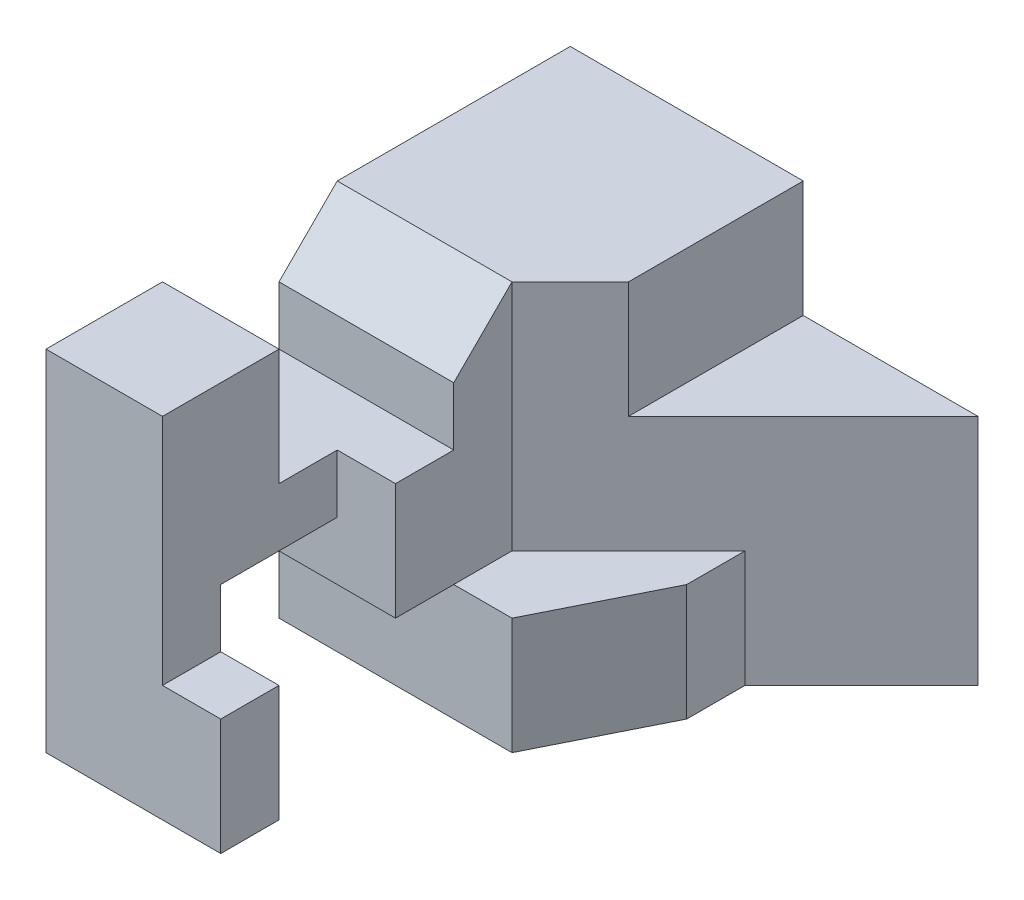
ISO-10303-21;
HEADER;
FILE_DESCRIPTION(('STEP AP214'),'2;1');
FILE_NAME('part.step','',(''),(''),'','','');
FILE_SCHEMA(('AUTOMOTIVE_DESIGN { 1 0 10303 214 1 1 1 1 }'));
ENDSEC;
DATA;
#1=APPLICATION_CONTEXT('core data for automotive mechanical design processes');
#2=APPLICATION_PROTOCOL_DEFINITION('international standard','automotive_design',2000,#1);
#3=PRODUCT_CONTEXT('',#1,'mechanical');
#4=PRODUCT('Part','Part','',(#3));
#5=PRODUCT_RELATED_PRODUCT_CATEGORY('part','',(#4));
#6=PRODUCT_DEFINITION_FORMATION('','',#4);
#7=PRODUCT_DEFINITION_CONTEXT('part definition',#1,'design');
#8=PRODUCT_DEFINITION('design','',#6,#7);
#9=PRODUCT_DEFINITION_SHAPE('','',#8);
#10=(LENGTH_UNIT() NAMED_UNIT(*) SI_UNIT(.MILLI.,.METRE.));
#11=(NAMED_UNIT(*) PLANE_ANGLE_UNIT() SI_UNIT($,.RADIAN.));
#12=(NAMED_UNIT(*) SI_UNIT($,.STERADIAN.) SOLID_ANGLE_UNIT());
#13=UNCERTAINTY_MEASURE_WITH_UNIT(LENGTH_MEASURE(1.E-05),#10,'distance_accuracy_value','');
#14=(GEOMETRIC_REPRESENTATION_CONTEXT(3) GLOBAL_UNCERTAINTY_ASSIGNED_CONTEXT((#13)) GLOBAL_UNIT_ASSIGNED_CONTEXT((#10,
#11,#12)) REPRESENTATION_CONTEXT('',''));
#15=CARTESIAN_POINT('',(0.,0.,0.));
#16=DIRECTION('',(0.,0.,1.));
#17=DIRECTION('',(1.,0.,0.));
#18=AXIS2_PLACEMENT_3D('',#15,#16,#17);
#19=CARTESIAN_POINT('',(3.5,3.,9.));
#20=DIRECTION('',(0.,-1.,0.));
#21=DIRECTION('',(1.,0.,0.));
#22=AXIS2_PLACEMENT_3D('',#19,#20,#21);
#23=PLANE('',#22);
#24=DIRECTION('',(0.,0.,-1.));
#25=VECTOR('',#24,1.);
#26=CARTESIAN_POINT('',(-3.5,3.,9.));
#27=LINE('',#26,#25);
#28=CARTESIAN_POINT('',(-3.5,3.,4.));
#29=VERTEX_POINT('',#28);
#30=CARTESIAN_POINT('',(-3.5,3.,0.));
#31=VERTEX_POINT('',#30);
#32=EDGE_CURVE('E259',#29,#31,#27,.T.);
#33=ORIENTED_EDGE('',*,*,#32,.F.);
#34=DIRECTION('',(1.,0.,0.));
#35=VECTOR('',#34,1.);
#36=CARTESIAN_POINT('',(-3.5,3.,4.));
#37=LINE('',#36,#35);
#38=CARTESIAN_POINT('',(-0.499999999999999,3.,4.));
#39=VERTEX_POINT('',#38);
#40=EDGE_CURVE('E310',#29,#39,#37,.T.);
#41=ORIENTED_EDGE('',*,*,#40,.T.);
#42=DIRECTION('',(-0.707106781186548,0.,0.707106781186548));
#43=VECTOR('',#42,1.);
#44=CARTESIAN_POINT('',(0.500000000000001,3.,3.));
#45=LINE('',#44,#43);
#46=CARTESIAN_POINT('',(0.500000000000001,3.,3.));
#47=VERTEX_POINT('',#46);
#48=EDGE_CURVE('E289',#47,#39,#45,.T.);
#49=ORIENTED_EDGE('',*,*,#48,.F.);
#50=DIRECTION('',(0.,0.,1.));
#51=VECTOR('',#50,1.);
#52=CARTESIAN_POINT('',(0.500000000000001,3.,0.));
#53=LINE('',#52,#51);
#54=CARTESIAN_POINT('',(0.500000000000001,3.,0.));
#55=VERTEX_POINT('',#54);
#56=EDGE_CURVE('E238',#55,#47,#53,.T.);
#57=ORIENTED_EDGE('',*,*,#56,.F.);
#58=DIRECTION('',(-1.,0.,0.));
#59=VECTOR('',#58,1.);
#60=CARTESIAN_POINT('',(3.5,3.,0.));
#61=LINE('',#60,#59);
#62=EDGE_CURVE('E255',#55,#31,#61,.T.);
#63=ORIENTED_EDGE('',*,*,#62,.T.);
#64=EDGE_LOOP('',(#33,#41,#49,#57,#63));
#65=FACE_BOUND('',#64,.T.);
#66=ADVANCED_FACE('F33',(#65),#23,.F.);
#67=CARTESIAN_POINT('',(0.500000000000001,1.,0.));
#68=DIRECTION('',(-1.,0.,0.));
#69=DIRECTION('',(0.,-1.,0.));
#70=AXIS2_PLACEMENT_3D('',#67,#68,#69);
#71=PLANE('',#70);
#72=ORIENTED_EDGE('',*,*,#56,.T.);
#73=DIRECTION('',(0.,1.,0.));
#74=VECTOR('',#73,1.);
#75=CARTESIAN_POINT('',(0.500000000000001,-1.,3.));
#76=LINE('',#75,#74);
#77=CARTESIAN_POINT('',(0.500000000000001,1.,3.));
#78=VERTEX_POINT('',#77);
#79=EDGE_CURVE('E292',#78,#47,#76,.T.);
#80=ORIENTED_EDGE('',*,*,#79,.F.);
#81=DIRECTION('',(0.,0.,1.));
#82=VECTOR('',#81,1.);
#83=CARTESIAN_POINT('',(0.500000000000001,1.,0.));
#84=LINE('',#83,#82);
#85=CARTESIAN_POINT('',(0.500000000000001,1.,0.));
#86=VERTEX_POINT('',#85);
#87=EDGE_CURVE('E243',#86,#78,#84,.T.);
#88=ORIENTED_EDGE('',*,*,#87,.F.);
#89=DIRECTION('',(0.,1.,0.));
#90=VECTOR('',#89,1.);
#91=CARTESIAN_POINT('',(0.500000000000001,1.,0.));
#92=LINE('',#91,#90);
#93=EDGE_CURVE('E246',#86,#55,#92,.T.);
#94=ORIENTED_EDGE('',*,*,#93,.T.);
#95=EDGE_LOOP('',(#72,#80,#88,#94));
#96=FACE_BOUND('',#95,.T.);
#97=ADVANCED_FACE('F444',(#96),#71,.F.);
#98=CARTESIAN_POINT('',(3.5,-3.,9.));
#99=DIRECTION('',(0.,1.,0.));
#100=DIRECTION('',(-1.,0.,0.));
#101=AXIS2_PLACEMENT_3D('',#98,#99,#100);
#102=PLANE('',#101);
#103=DIRECTION('',(1.,0.,0.));
#104=VECTOR('',#103,1.);
#105=CARTESIAN_POINT('',(-3.5,-3.,8.));
#106=LINE('',#105,#104);
#107=CARTESIAN_POINT('',(-3.5,-3.,8.));
#108=VERTEX_POINT('',#107);
#109=CARTESIAN_POINT('',(-0.499999999999998,-3.,8.));
#110=VERTEX_POINT('',#109);
#111=EDGE_CURVE('E199',#108,#110,#106,.T.);
#112=ORIENTED_EDGE('',*,*,#111,.T.);
#113=DIRECTION('',(0.,0.,1.));
#114=VECTOR('',#113,1.);
#115=CARTESIAN_POINT('',(-0.499999999999998,-3.,8.));
#116=LINE('',#115,#114);
#117=CARTESIAN_POINT('',(-0.499999999999998,-3.,9.));
#118=VERTEX_POINT('',#117);
#119=EDGE_CURVE('E187',#110,#118,#116,.T.);
#120=ORIENTED_EDGE('',*,*,#119,.T.);
#121=DIRECTION('',(1.,0.,0.));
#122=VECTOR('',#121,1.);
#123=CARTESIAN_POINT('',(3.5,-3.,9.));
#124=LINE('',#123,#122);
#125=CARTESIAN_POINT('',(-3.5,-3.,9.));
#126=VERTEX_POINT('',#125);
#127=EDGE_CURVE('E254',#126,#118,#124,.T.);
#128=ORIENTED_EDGE('',*,*,#127,.F.);
#129=DIRECTION('',(0.,0.,-1.));
#130=VECTOR('',#129,1.);
#131=CARTESIAN_POINT('',(-3.5,-3.,9.));
#132=LINE('',#131,#130);
#133=EDGE_CURVE('E207',#126,#108,#132,.T.);
#134=ORIENTED_EDGE('',*,*,#133,.T.);
#135=EDGE_LOOP('',(#112,#120,#128,#134));
#136=FACE_BOUND('',#135,.T.);
#137=ADVANCED_FACE('F205',(#136),#102,.F.);
#138=CARTESIAN_POINT('',(-3.5,-3.,9.));
#139=DIRECTION('',(1.,0.,0.));
#140=DIRECTION('',(0.,0.,-1.));
#141=AXIS2_PLACEMENT_3D('',#138,#139,#140);
#142=PLANE('',#141);
#143=DIRECTION('',(0.,0.,1.));
#144=VECTOR('',#143,1.);
#145=CARTESIAN_POINT('',(-3.5,0.,8.));
#146=LINE('',#145,#144);
#147=CARTESIAN_POINT('',(-3.5,0.,6.));
#148=VERTEX_POINT('',#147);
#149=CARTESIAN_POINT('',(-3.5,0.,8.));
#150=VERTEX_POINT('',#149);
#151=EDGE_CURVE('E324',#148,#150,#146,.T.);
#152=ORIENTED_EDGE('',*,*,#151,.T.);
#153=DIRECTION('',(0.,-1.,0.));
#154=VECTOR('',#153,1.);
#155=CARTESIAN_POINT('',(-3.5,-3.,8.));
#156=LINE('',#155,#154);
#157=EDGE_CURVE('E218',#150,#108,#156,.T.);
#158=ORIENTED_EDGE('',*,*,#157,.T.);
#159=ORIENTED_EDGE('',*,*,#133,.F.);
#160=DIRECTION('',(0.,-1.,0.));
#161=VECTOR('',#160,1.);
#162=CARTESIAN_POINT('',(-3.5,-3.,9.));
#163=LINE('',#162,#161);
#164=CARTESIAN_POINT('',(-3.5,3.,9.));
#165=VERTEX_POINT('',#164);
#166=EDGE_CURVE('E251',#165,#126,#163,.T.);
#167=ORIENTED_EDGE('',*,*,#166,.F.);
#168=CARTESIAN_POINT('',(-3.5,3.,7.));
#169=VERTEX_POINT('',#168);
#170=EDGE_CURVE('E270',#165,#169,#27,.T.);
#171=ORIENTED_EDGE('',*,*,#170,.T.);
#172=DIRECTION('',(0.,-1.,0.));
#173=VECTOR('',#172,1.);
#174=CARTESIAN_POINT('',(-3.5,1.,7.));
#175=LINE('',#174,#173);
#176=CARTESIAN_POINT('',(-3.5,1.,7.));
#177=VERTEX_POINT('',#176);
#178=EDGE_CURVE('E343',#169,#177,#175,.T.);
#179=ORIENTED_EDGE('',*,*,#178,.T.);
#180=DIRECTION('',(0.,0.,-1.));
#181=VECTOR('',#180,1.);
#182=CARTESIAN_POINT('',(-3.5,1.,5.));
#183=LINE('',#182,#181);
#184=CARTESIAN_POINT('',(-3.5,1.,5.));
#185=VERTEX_POINT('',#184);
#186=EDGE_CURVE('E346',#177,#185,#183,.T.);
#187=ORIENTED_EDGE('',*,*,#186,.T.);
#188=DIRECTION('',(0.,1.,0.));
#189=VECTOR('',#188,1.);
#190=CARTESIAN_POINT('',(-3.5,2.,5.));
#191=LINE('',#190,#189);
#192=CARTESIAN_POINT('',(-3.5,2.,5.));
#193=VERTEX_POINT('',#192);
#194=EDGE_CURVE('E350',#185,#193,#191,.T.);
#195=ORIENTED_EDGE('',*,*,#194,.T.);
#196=DIRECTION('',(0.,0.707106781186548,-0.707106781186548));
#197=VECTOR('',#196,1.);
#198=CARTESIAN_POINT('',(-3.5,3.,4.));
#199=LINE('',#198,#197);
#200=EDGE_CURVE('E353',#193,#29,#199,.T.);
#201=ORIENTED_EDGE('',*,*,#200,.T.);
#202=ORIENTED_EDGE('',*,*,#32,.T.);
#203=DIRECTION('',(0.,-1.,0.));
#204=VECTOR('',#203,1.);
#205=CARTESIAN_POINT('',(-3.5,-3.,0.));
#206=LINE('',#205,#204);
#207=CARTESIAN_POINT('',(-3.5,-3.,0.));
#208=VERTEX_POINT('',#207);
#209=EDGE_CURVE('E250',#31,#208,#206,.T.);
#210=ORIENTED_EDGE('',*,*,#209,.T.);
#211=CARTESIAN_POINT('',(-3.5,-3.,5.));
#212=VERTEX_POINT('',#211);
#213=EDGE_CURVE('E273',#212,#208,#132,.T.);
#214=ORIENTED_EDGE('',*,*,#213,.F.);
#215=DIRECTION('',(0.,1.,0.));
#216=VECTOR('',#215,1.);
#217=CARTESIAN_POINT('',(-3.5,-1.,5.));
#218=LINE('',#217,#216);
#219=CARTESIAN_POINT('',(-3.5,-1.,5.));
#220=VERTEX_POINT('',#219);
#221=EDGE_CURVE('E314',#212,#220,#218,.T.);
#222=ORIENTED_EDGE('',*,*,#221,.T.);
#223=DIRECTION('',(0.,0.,1.));
#224=VECTOR('',#223,1.);
#225=CARTESIAN_POINT('',(-3.5,-1.,8.));
#226=LINE('',#225,#224);
#227=CARTESIAN_POINT('',(-3.5,-1.,6.));
#228=VERTEX_POINT('',#227);
#229=EDGE_CURVE('E316',#220,#228,#226,.T.);
#230=ORIENTED_EDGE('',*,*,#229,.T.);
#231=DIRECTION('',(0.,1.,0.));
#232=VECTOR('',#231,1.);
#233=CARTESIAN_POINT('',(-3.5,0.,6.));
#234=LINE('',#233,#232);
#235=EDGE_CURVE('E406',#228,#148,#234,.T.);
#236=ORIENTED_EDGE('',*,*,#235,.T.);
#237=EDGE_LOOP('',(#152,#158,#159,#167,#171,#179,#187,#195,#201,#202,#210,#214,#222,#230,#236));
#238=FACE_BOUND('',#237,.T.);
#239=ADVANCED_FACE('F35',(#238),#142,.F.);
#240=DIRECTION('',(-0.447213595499958,0.,0.894427190999916));
#241=VECTOR('',#240,1.);
#242=CARTESIAN_POINT('',(1.5,-3.,3.));
#243=LINE('',#242,#241);
#244=CARTESIAN_POINT('',(1.5,-3.,3.));
#245=VERTEX_POINT('',#244);
#246=CARTESIAN_POINT('',(0.500000000000001,-3.,5.));
#247=VERTEX_POINT('',#246);
#248=EDGE_CURVE('E225',#245,#247,#243,.T.);
#249=ORIENTED_EDGE('',*,*,#248,.T.);
#250=DIRECTION('',(1.,0.,0.));
#251=VECTOR('',#250,1.);
#252=CARTESIAN_POINT('',(-3.5,-3.,5.));
#253=LINE('',#252,#251);
#254=EDGE_CURVE('E221',#212,#247,#253,.T.);
#255=ORIENTED_EDGE('',*,*,#254,.F.);
#256=ORIENTED_EDGE('',*,*,#213,.T.);
#257=DIRECTION('',(1.,0.,0.));
#258=VECTOR('',#257,1.);
#259=CARTESIAN_POINT('',(3.5,-3.,0.));
#260=LINE('',#259,#258);
#261=CARTESIAN_POINT('',(3.5,-3.,0.));
#262=VERTEX_POINT('',#261);
#263=EDGE_CURVE('E262',#208,#262,#260,.T.);
#264=ORIENTED_EDGE('',*,*,#263,.T.);
#265=DIRECTION('',(-0.707106781186547,0.,0.707106781186548));
#266=VECTOR('',#265,1.);
#267=CARTESIAN_POINT('',(3.5,-3.,0.));
#268=LINE('',#267,#266);
#269=CARTESIAN_POINT('',(1.5,-3.,2.));
#270=VERTEX_POINT('',#269);
#271=EDGE_CURVE('E208',#262,#270,#268,.T.);
#272=ORIENTED_EDGE('',*,*,#271,.T.);
#273=DIRECTION('',(0.,0.,1.));
#274=VECTOR('',#273,1.);
#275=CARTESIAN_POINT('',(1.5,-3.,2.));
#276=LINE('',#275,#274);
#277=EDGE_CURVE('E212',#270,#245,#276,.T.);
#278=ORIENTED_EDGE('',*,*,#277,.T.);
#279=EDGE_LOOP('',(#249,#255,#256,#264,#272,#278));
#280=FACE_BOUND('',#279,.T.);
#281=ADVANCED_FACE('F430',(#280),#102,.F.);
#282=DIRECTION('',(-1.,0.,0.));
#283=VECTOR('',#282,1.);
#284=CARTESIAN_POINT('',(3.5,3.,9.));
#285=LINE('',#284,#283);
#286=CARTESIAN_POINT('',(-1.5,3.,9.));
#287=VERTEX_POINT('',#286);
#288=EDGE_CURVE('E257',#287,#165,#285,.T.);
#289=ORIENTED_EDGE('',*,*,#288,.F.);
#290=DIRECTION('',(0.,0.,1.));
#291=VECTOR('',#290,1.);
#292=CARTESIAN_POINT('',(-1.5,3.,9.));
#293=LINE('',#292,#291);
#294=CARTESIAN_POINT('',(-1.5,3.,7.));
#295=VERTEX_POINT('',#294);
#296=EDGE_CURVE('E381',#295,#287,#293,.T.);
#297=ORIENTED_EDGE('',*,*,#296,.F.);
#298=DIRECTION('',(1.,0.,0.));
#299=VECTOR('',#298,1.);
#300=CARTESIAN_POINT('',(-3.5,3.,7.));
#301=LINE('',#300,#299);
#302=EDGE_CURVE('E307',#169,#295,#301,.T.);
#303=ORIENTED_EDGE('',*,*,#302,.F.);
#304=ORIENTED_EDGE('',*,*,#170,.F.);
#305=EDGE_LOOP('',(#289,#297,#303,#304));
#306=FACE_BOUND('',#305,.T.);
#307=ADVANCED_FACE('F380',(#306),#23,.F.);
#308=CARTESIAN_POINT('',(0.,0.,9.));
#309=DIRECTION('',(0.,0.,1.));
#310=DIRECTION('',(1.,0.,0.));
#311=AXIS2_PLACEMENT_3D('',#308,#309,#310);
#312=PLANE('',#311);
#313=DIRECTION('',(0.,1.,0.));
#314=VECTOR('',#313,1.);
#315=CARTESIAN_POINT('',(-0.499999999999998,-3.,9.));
#316=LINE('',#315,#314);
#317=CARTESIAN_POINT('',(-0.499999999999998,-1.,9.));
#318=VERTEX_POINT('',#317);
#319=EDGE_CURVE('E190',#118,#318,#316,.T.);
#320=ORIENTED_EDGE('',*,*,#319,.T.);
#321=DIRECTION('',(1.,0.,0.));
#322=VECTOR('',#321,1.);
#323=CARTESIAN_POINT('',(-0.499999999999998,-1.,9.));
#324=LINE('',#323,#322);
#325=CARTESIAN_POINT('',(-1.5,-1.,9.));
#326=VERTEX_POINT('',#325);
#327=EDGE_CURVE('E302',#326,#318,#324,.T.);
#328=ORIENTED_EDGE('',*,*,#327,.F.);
#329=DIRECTION('',(0.,-1.,0.));
#330=VECTOR('',#329,1.);
#331=CARTESIAN_POINT('',(-1.5,-1.,9.));
#332=LINE('',#331,#330);
#333=EDGE_CURVE('E386',#287,#326,#332,.T.);
#334=ORIENTED_EDGE('',*,*,#333,.F.);
#335=ORIENTED_EDGE('',*,*,#288,.T.);
#336=ORIENTED_EDGE('',*,*,#166,.T.);
#337=ORIENTED_EDGE('',*,*,#127,.T.);
#338=EDGE_LOOP('',(#320,#328,#334,#335,#336,#337));
#339=FACE_BOUND('',#338,.T.);
#340=ADVANCED_FACE('F383',(#339),#312,.T.);
#341=CARTESIAN_POINT('',(0.,0.,0.));
#342=DIRECTION('',(0.,0.,1.));
#343=DIRECTION('',(1.,0.,0.));
#344=AXIS2_PLACEMENT_3D('',#341,#342,#343);
#345=PLANE('',#344);
#346=ORIENTED_EDGE('',*,*,#62,.F.);
#347=ORIENTED_EDGE('',*,*,#93,.F.);
#348=DIRECTION('',(-1.,0.,0.));
#349=VECTOR('',#348,1.);
#350=CARTESIAN_POINT('',(3.5,1.,0.));
#351=LINE('',#350,#349);
#352=CARTESIAN_POINT('',(3.5,1.,0.));
#353=VERTEX_POINT('',#352);
#354=EDGE_CURVE('E241',#353,#86,#351,.T.);
#355=ORIENTED_EDGE('',*,*,#354,.F.);
#356=DIRECTION('',(0.,1.,0.));
#357=VECTOR('',#356,1.);
#358=CARTESIAN_POINT('',(3.5,-3.,0.));
#359=LINE('',#358,#357);
#360=EDGE_CURVE('E265',#262,#353,#359,.T.);
#361=ORIENTED_EDGE('',*,*,#360,.F.);
#362=ORIENTED_EDGE('',*,*,#263,.F.);
#363=ORIENTED_EDGE('',*,*,#209,.F.);
#364=EDGE_LOOP('',(#346,#347,#355,#361,#362,#363));
#365=FACE_BOUND('',#364,.T.);
#366=ADVANCED_FACE('F425',(#365),#345,.F.);
#367=CARTESIAN_POINT('',(0.,1.,0.));
#368=DIRECTION('',(0.,1.,0.));
#369=DIRECTION('',(-1.,0.,0.));
#370=AXIS2_PLACEMENT_3D('',#367,#368,#369);
#371=PLANE('',#370);
#372=DIRECTION('',(0.707106781186547,0.,-0.707106781186548));
#373=VECTOR('',#372,1.);
#374=CARTESIAN_POINT('',(0.500000000000001,1.,3.));
#375=LINE('',#374,#373);
#376=EDGE_CURVE('E239',#78,#353,#375,.T.);
#377=ORIENTED_EDGE('',*,*,#376,.T.);
#378=ORIENTED_EDGE('',*,*,#354,.T.);
#379=ORIENTED_EDGE('',*,*,#87,.T.);
#380=EDGE_LOOP('',(#377,#378,#379));
#381=FACE_BOUND('',#380,.T.);
#382=ADVANCED_FACE('F442',(#381),#371,.T.);
#383=CARTESIAN_POINT('',(3.5,-1.,0.));
#384=DIRECTION('',(-0.707106781186548,0.,-0.707106781186547));
#385=DIRECTION('',(-0.707106781186547,0.,0.707106781186548));
#386=AXIS2_PLACEMENT_3D('',#383,#384,#385);
#387=PLANE('',#386);
#388=DIRECTION('',(-0.707106781186547,0.,0.707106781186548));
#389=VECTOR('',#388,1.);
#390=CARTESIAN_POINT('',(3.5,-1.,0.));
#391=LINE('',#390,#389);
#392=CARTESIAN_POINT('',(1.5,-1.,2.));
#393=VERTEX_POINT('',#392);
#394=CARTESIAN_POINT('',(-0.499999999999999,-1.,4.));
#395=VERTEX_POINT('',#394);
#396=EDGE_CURVE('E232',#393,#395,#391,.T.);
#397=ORIENTED_EDGE('',*,*,#396,.F.);
#398=DIRECTION('',(0.,1.,0.));
#399=VECTOR('',#398,1.);
#400=CARTESIAN_POINT('',(1.5,-3.,2.));
#401=LINE('',#400,#399);
#402=EDGE_CURVE('E228',#270,#393,#401,.T.);
#403=ORIENTED_EDGE('',*,*,#402,.F.);
#404=ORIENTED_EDGE('',*,*,#271,.F.);
#405=ORIENTED_EDGE('',*,*,#360,.T.);
#406=ORIENTED_EDGE('',*,*,#376,.F.);
#407=ORIENTED_EDGE('',*,*,#79,.T.);
#408=ORIENTED_EDGE('',*,*,#48,.T.);
#409=DIRECTION('',(0.,1.,0.));
#410=VECTOR('',#409,1.);
#411=CARTESIAN_POINT('',(-0.499999999999999,-1.,4.));
#412=LINE('',#411,#410);
#413=EDGE_CURVE('E286',#395,#39,#412,.T.);
#414=ORIENTED_EDGE('',*,*,#413,.F.);
#415=EDGE_LOOP('',(#397,#403,#404,#405,#406,#407,#408,#414));
#416=FACE_BOUND('',#415,.T.);
#417=ADVANCED_FACE('F282',(#416),#387,.F.);
#418=CARTESIAN_POINT('',(0.,-1.,0.));
#419=DIRECTION('',(0.,-1.,0.));
#420=DIRECTION('',(1.,0.,0.));
#421=AXIS2_PLACEMENT_3D('',#418,#419,#420);
#422=PLANE('',#421);
#423=ORIENTED_EDGE('',*,*,#396,.T.);
#424=DIRECTION('',(0.,0.,1.));
#425=VECTOR('',#424,1.);
#426=CARTESIAN_POINT('',(-0.499999999999999,-1.,4.));
#427=LINE('',#426,#425);
#428=CARTESIAN_POINT('',(-0.499999999999999,-1.,5.));
#429=VERTEX_POINT('',#428);
#430=EDGE_CURVE('E295',#395,#429,#427,.T.);
#431=ORIENTED_EDGE('',*,*,#430,.T.);
#432=DIRECTION('',(1.,0.,0.));
#433=VECTOR('',#432,1.);
#434=CARTESIAN_POINT('',(-3.5,-1.,5.));
#435=LINE('',#434,#433);
#436=CARTESIAN_POINT('',(0.500000000000001,-1.,5.));
#437=VERTEX_POINT('',#436);
#438=EDGE_CURVE('E215',#429,#437,#435,.T.);
#439=ORIENTED_EDGE('',*,*,#438,.T.);
#440=DIRECTION('',(0.447213595499958,0.,-0.894427190999916));
#441=VECTOR('',#440,1.);
#442=CARTESIAN_POINT('',(2.4,-1.,1.2));
#443=LINE('',#442,#441);
#444=CARTESIAN_POINT('',(1.5,-1.,3.));
#445=VERTEX_POINT('',#444);
#446=EDGE_CURVE('E11',#437,#445,#443,.T.);
#447=ORIENTED_EDGE('',*,*,#446,.T.);
#448=DIRECTION('',(0.,0.,-1.));
#449=VECTOR('',#448,1.);
#450=CARTESIAN_POINT('',(1.5,-1.,0.));
#451=LINE('',#450,#449);
#452=EDGE_CURVE('E41',#445,#393,#451,.T.);
#453=ORIENTED_EDGE('',*,*,#452,.T.);
#454=EDGE_LOOP('',(#423,#431,#439,#447,#453));
#455=FACE_BOUND('',#454,.T.);
#456=ADVANCED_FACE('F277',(#455),#422,.F.);
#457=CARTESIAN_POINT('',(1.5,-3.,3.));
#458=DIRECTION('',(-0.894427190999916,0.,-0.447213595499958));
#459=DIRECTION('',(-0.447213595499958,0.,0.894427190999916));
#460=AXIS2_PLACEMENT_3D('',#457,#458,#459);
#461=PLANE('',#460);
#462=DIRECTION('',(0.,1.,0.));
#463=VECTOR('',#462,1.);
#464=CARTESIAN_POINT('',(0.500000000000001,-3.,5.));
#465=LINE('',#464,#463);
#466=EDGE_CURVE('E229',#247,#437,#465,.T.);
#467=ORIENTED_EDGE('',*,*,#466,.F.);
#468=ORIENTED_EDGE('',*,*,#248,.F.);
#469=DIRECTION('',(0.,1.,0.));
#470=VECTOR('',#469,1.);
#471=CARTESIAN_POINT('',(1.5,-3.,3.));
#472=LINE('',#471,#470);
#473=EDGE_CURVE('E233',#245,#445,#472,.T.);
#474=ORIENTED_EDGE('',*,*,#473,.T.);
#475=ORIENTED_EDGE('',*,*,#446,.F.);
#476=EDGE_LOOP('',(#467,#468,#474,#475));
#477=FACE_BOUND('',#476,.T.);
#478=ADVANCED_FACE('F436',(#477),#461,.F.);
#479=CARTESIAN_POINT('',(1.5,-3.,2.));
#480=DIRECTION('',(-1.,0.,0.));
#481=DIRECTION('',(0.,0.,1.));
#482=AXIS2_PLACEMENT_3D('',#479,#480,#481);
#483=PLANE('',#482);
#484=ORIENTED_EDGE('',*,*,#473,.F.);
#485=ORIENTED_EDGE('',*,*,#277,.F.);
#486=ORIENTED_EDGE('',*,*,#402,.T.);
#487=ORIENTED_EDGE('',*,*,#452,.F.);
#488=EDGE_LOOP('',(#484,#485,#486,#487));
#489=FACE_BOUND('',#488,.T.);
#490=ADVANCED_FACE('F437',(#489),#483,.F.);
#491=CARTESIAN_POINT('',(-3.5,-3.,8.));
#492=DIRECTION('',(0.,0.,1.));
#493=DIRECTION('',(1.,0.,0.));
#494=AXIS2_PLACEMENT_3D('',#491,#492,#493);
#495=PLANE('',#494);
#496=DIRECTION('',(1.,0.,0.));
#497=VECTOR('',#496,1.);
#498=CARTESIAN_POINT('',(-3.5,-1.,8.));
#499=LINE('',#498,#497);
#500=CARTESIAN_POINT('',(-1.5,-1.,8.));
#501=VERTEX_POINT('',#500);
#502=CARTESIAN_POINT('',(-0.499999999999998,-1.,8.));
#503=VERTEX_POINT('',#502);
#504=EDGE_CURVE('E202',#501,#503,#499,.T.);
#505=ORIENTED_EDGE('',*,*,#504,.T.);
#506=DIRECTION('',(0.,1.,0.));
#507=VECTOR('',#506,1.);
#508=CARTESIAN_POINT('',(-0.499999999999998,-3.,8.));
#509=LINE('',#508,#507);
#510=EDGE_CURVE('E48',#110,#503,#509,.T.);
#511=ORIENTED_EDGE('',*,*,#510,.F.);
#512=ORIENTED_EDGE('',*,*,#111,.F.);
#513=ORIENTED_EDGE('',*,*,#157,.F.);
#514=DIRECTION('',(1.,0.,0.));
#515=VECTOR('',#514,1.);
#516=CARTESIAN_POINT('',(-3.5,0.,8.));
#517=LINE('',#516,#515);
#518=CARTESIAN_POINT('',(-1.5,0.,8.));
#519=VERTEX_POINT('',#518);
#520=EDGE_CURVE('E327',#150,#519,#517,.T.);
#521=ORIENTED_EDGE('',*,*,#520,.T.);
#522=DIRECTION('',(0.,1.,0.));
#523=VECTOR('',#522,1.);
#524=CARTESIAN_POINT('',(-1.5,0.,8.));
#525=LINE('',#524,#523);
#526=EDGE_CURVE('E391',#501,#519,#525,.T.);
#527=ORIENTED_EDGE('',*,*,#526,.F.);
#528=EDGE_LOOP('',(#505,#511,#512,#513,#521,#527));
#529=FACE_BOUND('',#528,.T.);
#530=ADVANCED_FACE('F198',(#529),#495,.F.);
#531=CARTESIAN_POINT('',(-3.5,-1.,8.));
#532=DIRECTION('',(0.,1.,0.));
#533=DIRECTION('',(-1.,0.,0.));
#534=AXIS2_PLACEMENT_3D('',#531,#532,#533);
#535=PLANE('',#534);
#536=CARTESIAN_POINT('',(-0.499999999999999,-1.,6.));
#537=VERTEX_POINT('',#536);
#538=EDGE_CURVE('E300',#429,#537,#427,.T.);
#539=ORIENTED_EDGE('',*,*,#538,.T.);
#540=DIRECTION('',(1.,0.,0.));
#541=VECTOR('',#540,1.);
#542=CARTESIAN_POINT('',(-3.5,-1.,6.));
#543=LINE('',#542,#541);
#544=EDGE_CURVE('E336',#228,#537,#543,.T.);
#545=ORIENTED_EDGE('',*,*,#544,.F.);
#546=ORIENTED_EDGE('',*,*,#229,.F.);
#547=EDGE_CURVE('E209',#220,#429,#435,.T.);
#548=ORIENTED_EDGE('',*,*,#547,.T.);
#549=EDGE_LOOP('',(#539,#545,#546,#548));
#550=FACE_BOUND('',#549,.T.);
#551=ADVANCED_FACE('F496',(#550),#535,.F.);
#552=CARTESIAN_POINT('',(-3.5,-1.,5.));
#553=DIRECTION('',(0.,0.,-1.));
#554=DIRECTION('',(0.,1.,0.));
#555=AXIS2_PLACEMENT_3D('',#552,#553,#554);
#556=PLANE('',#555);
#557=ORIENTED_EDGE('',*,*,#466,.T.);
#558=ORIENTED_EDGE('',*,*,#438,.F.);
#559=ORIENTED_EDGE('',*,*,#547,.F.);
#560=ORIENTED_EDGE('',*,*,#221,.F.);
#561=ORIENTED_EDGE('',*,*,#254,.T.);
#562=EDGE_LOOP('',(#557,#558,#559,#560,#561));
#563=FACE_BOUND('',#562,.T.);
#564=ADVANCED_FACE('F434',(#563),#556,.F.);
#565=CARTESIAN_POINT('',(0.,-1.,0.));
#566=DIRECTION('',(0.,-1.,0.));
#567=DIRECTION('',(0.,0.,-1.));
#568=AXIS2_PLACEMENT_3D('',#565,#566,#567);
#569=PLANE('',#568);
#570=ORIENTED_EDGE('',*,*,#327,.T.);
#571=DIRECTION('',(0.,0.,1.));
#572=VECTOR('',#571,1.);
#573=CARTESIAN_POINT('',(-0.499999999999998,-1.,8.));
#574=LINE('',#573,#572);
#575=EDGE_CURVE('E194',#503,#318,#574,.T.);
#576=ORIENTED_EDGE('',*,*,#575,.F.);
#577=ORIENTED_EDGE('',*,*,#504,.F.);
#578=DIRECTION('',(0.,0.,-1.));
#579=VECTOR('',#578,1.);
#580=CARTESIAN_POINT('',(-1.5,-1.,8.));
#581=LINE('',#580,#579);
#582=EDGE_CURVE('E389',#326,#501,#581,.T.);
#583=ORIENTED_EDGE('',*,*,#582,.F.);
#584=EDGE_LOOP('',(#570,#576,#577,#583));
#585=FACE_BOUND('',#584,.T.);
#586=ADVANCED_FACE('F505',(#585),#569,.F.);
#587=CARTESIAN_POINT('',(-0.499999999999999,-1.,4.));
#588=DIRECTION('',(-1.,0.,0.));
#589=DIRECTION('',(0.,0.,1.));
#590=AXIS2_PLACEMENT_3D('',#587,#588,#589);
#591=PLANE('',#590);
#592=DIRECTION('',(0.,0.,-1.));
#593=VECTOR('',#592,1.);
#594=CARTESIAN_POINT('',(-0.499999999999999,1.,5.));
#595=LINE('',#594,#593);
#596=CARTESIAN_POINT('',(-0.499999999999999,1.,6.));
#597=VERTEX_POINT('',#596);
#598=CARTESIAN_POINT('',(-0.499999999999999,1.,5.));
#599=VERTEX_POINT('',#598);
#600=EDGE_CURVE('E331',#597,#599,#595,.T.);
#601=ORIENTED_EDGE('',*,*,#600,.F.);
#602=DIRECTION('',(0.,1.,0.));
#603=VECTOR('',#602,1.);
#604=CARTESIAN_POINT('',(-0.499999999999999,0.,6.));
#605=LINE('',#604,#603);
#606=EDGE_CURVE('E339',#537,#597,#605,.T.);
#607=ORIENTED_EDGE('',*,*,#606,.F.);
#608=ORIENTED_EDGE('',*,*,#538,.F.);
#609=ORIENTED_EDGE('',*,*,#430,.F.);
#610=ORIENTED_EDGE('',*,*,#413,.T.);
#611=DIRECTION('',(0.,0.707106781186548,-0.707106781186548));
#612=VECTOR('',#611,1.);
#613=CARTESIAN_POINT('',(-0.499999999999999,3.,4.));
#614=LINE('',#613,#612);
#615=CARTESIAN_POINT('',(-0.499999999999999,2.,5.));
#616=VERTEX_POINT('',#615);
#617=EDGE_CURVE('E347',#616,#39,#614,.T.);
#618=ORIENTED_EDGE('',*,*,#617,.F.);
#619=DIRECTION('',(0.,1.,0.));
#620=VECTOR('',#619,1.);
#621=CARTESIAN_POINT('',(-0.499999999999999,2.,5.));
#622=LINE('',#621,#620);
#623=EDGE_CURVE('E334',#599,#616,#622,.T.);
#624=ORIENTED_EDGE('',*,*,#623,.F.);
#625=EDGE_LOOP('',(#601,#607,#608,#609,#610,#618,#624));
#626=FACE_BOUND('',#625,.T.);
#627=ADVANCED_FACE('F297',(#626),#591,.F.);
#628=CARTESIAN_POINT('',(-3.5,3.,4.));
#629=DIRECTION('',(0.,-0.707106781186548,-0.707106781186548));
#630=DIRECTION('',(0.,0.707106781186548,-0.707106781186548));
#631=AXIS2_PLACEMENT_3D('',#628,#629,#630);
#632=PLANE('',#631);
#633=ORIENTED_EDGE('',*,*,#617,.T.);
#634=ORIENTED_EDGE('',*,*,#40,.F.);
#635=ORIENTED_EDGE('',*,*,#200,.F.);
#636=DIRECTION('',(1.,0.,0.));
#637=VECTOR('',#636,1.);
#638=CARTESIAN_POINT('',(-3.5,2.,5.));
#639=LINE('',#638,#637);
#640=EDGE_CURVE('E361',#193,#616,#639,.T.);
#641=ORIENTED_EDGE('',*,*,#640,.T.);
#642=EDGE_LOOP('',(#633,#634,#635,#641));
#643=FACE_BOUND('',#642,.T.);
#644=ADVANCED_FACE('F553',(#643),#632,.F.);
#645=CARTESIAN_POINT('',(-3.5,2.,5.));
#646=DIRECTION('',(0.,0.,-1.));
#647=DIRECTION('',(-1.,0.,0.));
#648=AXIS2_PLACEMENT_3D('',#645,#646,#647);
#649=PLANE('',#648);
#650=ORIENTED_EDGE('',*,*,#623,.T.);
#651=ORIENTED_EDGE('',*,*,#640,.F.);
#652=ORIENTED_EDGE('',*,*,#194,.F.);
#653=DIRECTION('',(1.,0.,0.));
#654=VECTOR('',#653,1.);
#655=CARTESIAN_POINT('',(-3.5,1.,5.));
#656=LINE('',#655,#654);
#657=EDGE_CURVE('E363',#185,#599,#656,.T.);
#658=ORIENTED_EDGE('',*,*,#657,.T.);
#659=EDGE_LOOP('',(#650,#651,#652,#658));
#660=FACE_BOUND('',#659,.T.);
#661=ADVANCED_FACE('F413',(#660),#649,.F.);
#662=CARTESIAN_POINT('',(-3.5,1.,5.));
#663=DIRECTION('',(0.,-1.,0.));
#664=DIRECTION('',(1.,0.,0.));
#665=AXIS2_PLACEMENT_3D('',#662,#663,#664);
#666=PLANE('',#665);
#667=DIRECTION('',(0.,0.,1.));
#668=VECTOR('',#667,1.);
#669=CARTESIAN_POINT('',(-1.5,1.,7.));
#670=LINE('',#669,#668);
#671=CARTESIAN_POINT('',(-1.5,1.,6.));
#672=VERTEX_POINT('',#671);
#673=CARTESIAN_POINT('',(-1.5,1.,7.));
#674=VERTEX_POINT('',#673);
#675=EDGE_CURVE('E399',#672,#674,#670,.T.);
#676=ORIENTED_EDGE('',*,*,#675,.F.);
#677=DIRECTION('',(1.,0.,0.));
#678=VECTOR('',#677,1.);
#679=CARTESIAN_POINT('',(-1.5,1.,6.));
#680=LINE('',#679,#678);
#681=EDGE_CURVE('E403',#672,#597,#680,.T.);
#682=ORIENTED_EDGE('',*,*,#681,.T.);
#683=ORIENTED_EDGE('',*,*,#600,.T.);
#684=ORIENTED_EDGE('',*,*,#657,.F.);
#685=ORIENTED_EDGE('',*,*,#186,.F.);
#686=DIRECTION('',(1.,0.,0.));
#687=VECTOR('',#686,1.);
#688=CARTESIAN_POINT('',(-3.5,1.,7.));
#689=LINE('',#688,#687);
#690=EDGE_CURVE('E365',#177,#674,#689,.T.);
#691=ORIENTED_EDGE('',*,*,#690,.T.);
#692=EDGE_LOOP('',(#676,#682,#683,#684,#685,#691));
#693=FACE_BOUND('',#692,.T.);
#694=ADVANCED_FACE('F410',(#693),#666,.F.);
#695=CARTESIAN_POINT('',(-3.5,1.,7.));
#696=DIRECTION('',(0.,0.,1.));
#697=DIRECTION('',(1.,0.,0.));
#698=AXIS2_PLACEMENT_3D('',#695,#696,#697);
#699=PLANE('',#698);
#700=ORIENTED_EDGE('',*,*,#302,.T.);
#701=DIRECTION('',(0.,1.,0.));
#702=VECTOR('',#701,1.);
#703=CARTESIAN_POINT('',(-1.5,3.,7.));
#704=LINE('',#703,#702);
#705=EDGE_CURVE('E375',#674,#295,#704,.T.);
#706=ORIENTED_EDGE('',*,*,#705,.F.);
#707=ORIENTED_EDGE('',*,*,#690,.F.);
#708=ORIENTED_EDGE('',*,*,#178,.F.);
#709=EDGE_LOOP('',(#700,#706,#707,#708));
#710=FACE_BOUND('',#709,.T.);
#711=ADVANCED_FACE('F374',(#710),#699,.F.);
#712=CARTESIAN_POINT('',(-3.5,0.,8.));
#713=DIRECTION('',(0.,1.,0.));
#714=DIRECTION('',(-1.,0.,0.));
#715=AXIS2_PLACEMENT_3D('',#712,#713,#714);
#716=PLANE('',#715);
#717=DIRECTION('',(1.,0.,0.));
#718=VECTOR('',#717,1.);
#719=CARTESIAN_POINT('',(-3.5,0.,6.));
#720=LINE('',#719,#718);
#721=CARTESIAN_POINT('',(-1.5,0.,6.));
#722=VERTEX_POINT('',#721);
#723=EDGE_CURVE('E332',#148,#722,#720,.T.);
#724=ORIENTED_EDGE('',*,*,#723,.T.);
#725=DIRECTION('',(0.,0.,-1.));
#726=VECTOR('',#725,1.);
#727=CARTESIAN_POINT('',(-1.5,0.,6.));
#728=LINE('',#727,#726);
#729=EDGE_CURVE('E56',#519,#722,#728,.T.);
#730=ORIENTED_EDGE('',*,*,#729,.F.);
#731=ORIENTED_EDGE('',*,*,#520,.F.);
#732=ORIENTED_EDGE('',*,*,#151,.F.);
#733=EDGE_LOOP('',(#724,#730,#731,#732));
#734=FACE_BOUND('',#733,.T.);
#735=ADVANCED_FACE('F330',(#734),#716,.F.);
#736=CARTESIAN_POINT('',(-3.5,0.,6.));
#737=DIRECTION('',(0.,0.,-1.));
#738=DIRECTION('',(-1.,0.,0.));
#739=AXIS2_PLACEMENT_3D('',#736,#737,#738);
#740=PLANE('',#739);
#741=ORIENTED_EDGE('',*,*,#606,.T.);
#742=ORIENTED_EDGE('',*,*,#681,.F.);
#743=DIRECTION('',(0.,1.,0.));
#744=VECTOR('',#743,1.);
#745=CARTESIAN_POINT('',(-1.5,1.,6.));
#746=LINE('',#745,#744);
#747=EDGE_CURVE('E397',#722,#672,#746,.T.);
#748=ORIENTED_EDGE('',*,*,#747,.F.);
#749=ORIENTED_EDGE('',*,*,#723,.F.);
#750=ORIENTED_EDGE('',*,*,#235,.F.);
#751=ORIENTED_EDGE('',*,*,#544,.T.);
#752=EDGE_LOOP('',(#741,#742,#748,#749,#750,#751));
#753=FACE_BOUND('',#752,.T.);
#754=ADVANCED_FACE('F408',(#753),#740,.F.);
#755=CARTESIAN_POINT('',(-1.5,0.,0.));
#756=DIRECTION('',(-1.,0.,0.));
#757=DIRECTION('',(0.,-1.,0.));
#758=AXIS2_PLACEMENT_3D('',#755,#756,#757);
#759=PLANE('',#758);
#760=ORIENTED_EDGE('',*,*,#333,.T.);
#761=ORIENTED_EDGE('',*,*,#582,.T.);
#762=ORIENTED_EDGE('',*,*,#526,.T.);
#763=ORIENTED_EDGE('',*,*,#729,.T.);
#764=ORIENTED_EDGE('',*,*,#747,.T.);
#765=ORIENTED_EDGE('',*,*,#675,.T.);
#766=ORIENTED_EDGE('',*,*,#705,.T.);
#767=ORIENTED_EDGE('',*,*,#296,.T.);
#768=EDGE_LOOP('',(#760,#761,#762,#763,#764,#765,#766,#767));
#769=FACE_BOUND('',#768,.T.);
#770=ADVANCED_FACE('F479',(#769),#759,.F.);
#771=CARTESIAN_POINT('',(-0.499999999999998,-3.,8.));
#772=DIRECTION('',(-1.,0.,0.));
#773=DIRECTION('',(0.,0.,1.));
#774=AXIS2_PLACEMENT_3D('',#771,#772,#773);
#775=PLANE('',#774);
#776=ORIENTED_EDGE('',*,*,#575,.T.);
#777=ORIENTED_EDGE('',*,*,#319,.F.);
#778=ORIENTED_EDGE('',*,*,#119,.F.);
#779=ORIENTED_EDGE('',*,*,#510,.T.);
#780=EDGE_LOOP('',(#776,#777,#778,#779));
#781=FACE_BOUND('',#780,.T.);
#782=ADVANCED_FACE('F188',(#781),#775,.F.);
#783=CLOSED_SHELL('',(#66,#97,#137,#239,#281,#307,#340,#366,#382,#417,#456,#478,#490,#530,#551,
#564,#586,#627,#644,#661,#694,#711,#735,#754,#770,#782));
#784=MANIFOLD_SOLID_BREP('B2',#783);
#785=ADVANCED_BREP_SHAPE_REPRESENTATION('',(#18,#784),#14);
#786=SHAPE_DEFINITION_REPRESENTATION(#9,#785);
ENDSEC;
END-ISO-10303-21;
